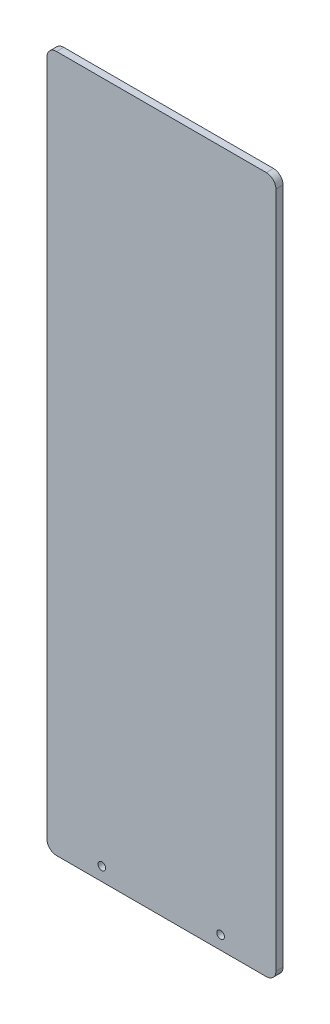
ISO-10303-21;
HEADER;
FILE_DESCRIPTION(('STEP AP214'),'2;1');
FILE_NAME('part.step','',(''),(''),'','','');
FILE_SCHEMA(('AUTOMOTIVE_DESIGN { 1 0 10303 214 1 1 1 1 }'));
ENDSEC;
DATA;
#1=APPLICATION_CONTEXT('core data for automotive mechanical design processes');
#2=APPLICATION_PROTOCOL_DEFINITION('international standard','automotive_design',2000,#1);
#3=PRODUCT_CONTEXT('',#1,'mechanical');
#4=PRODUCT('Part','Part','',(#3));
#5=PRODUCT_RELATED_PRODUCT_CATEGORY('part','',(#4));
#6=PRODUCT_DEFINITION_FORMATION('','',#4);
#7=PRODUCT_DEFINITION_CONTEXT('part definition',#1,'design');
#8=PRODUCT_DEFINITION('design','',#6,#7);
#9=PRODUCT_DEFINITION_SHAPE('','',#8);
#10=(LENGTH_UNIT() NAMED_UNIT(*) SI_UNIT(.MILLI.,.METRE.));
#11=(NAMED_UNIT(*) PLANE_ANGLE_UNIT() SI_UNIT($,.RADIAN.));
#12=(NAMED_UNIT(*) SI_UNIT($,.STERADIAN.) SOLID_ANGLE_UNIT());
#13=UNCERTAINTY_MEASURE_WITH_UNIT(LENGTH_MEASURE(1.E-05),#10,'distance_accuracy_value','');
#14=(GEOMETRIC_REPRESENTATION_CONTEXT(3) GLOBAL_UNCERTAINTY_ASSIGNED_CONTEXT((#13)) GLOBAL_UNIT_ASSIGNED_CONTEXT((#10,
#11,#12)) REPRESENTATION_CONTEXT('',''));
#15=CARTESIAN_POINT('',(0.,0.,0.));
#16=DIRECTION('',(0.,0.,1.));
#17=DIRECTION('',(1.,0.,0.));
#18=AXIS2_PLACEMENT_3D('',#15,#16,#17);
#19=CARTESIAN_POINT('',(0.,463.55,4.7625));
#20=DIRECTION('',(1.,0.,0.));
#21=DIRECTION('',(0.,1.,0.));
#22=AXIS2_PLACEMENT_3D('',#19,#20,#21);
#23=PLANE('',#22);
#24=DIRECTION('',(0.,-1.,0.));
#25=VECTOR('',#24,1.);
#26=CARTESIAN_POINT('',(0.,463.55,0.));
#27=LINE('',#26,#25);
#28=CARTESIAN_POINT('',(0.,457.2,0.));
#29=VERTEX_POINT('',#28);
#30=CARTESIAN_POINT('',(0.,6.35000000000002,0.));
#31=VERTEX_POINT('',#30);
#32=EDGE_CURVE('E132',#29,#31,#27,.T.);
#33=ORIENTED_EDGE('',*,*,#32,.T.);
#34=DIRECTION('',(0.,0.,-1.));
#35=VECTOR('',#34,1.);
#36=CARTESIAN_POINT('',(0.,6.35000000000002,4.7625));
#37=LINE('',#36,#35);
#38=CARTESIAN_POINT('',(0.,6.35000000000002,4.7625));
#39=VERTEX_POINT('',#38);
#40=EDGE_CURVE('E154',#31,#39,#37,.F.);
#41=ORIENTED_EDGE('',*,*,#40,.T.);
#42=DIRECTION('',(0.,-1.,0.));
#43=VECTOR('',#42,1.);
#44=CARTESIAN_POINT('',(0.,463.55,4.7625));
#45=LINE('',#44,#43);
#46=CARTESIAN_POINT('',(0.,457.2,4.7625));
#47=VERTEX_POINT('',#46);
#48=EDGE_CURVE('E130',#47,#39,#45,.T.);
#49=ORIENTED_EDGE('',*,*,#48,.F.);
#50=DIRECTION('',(0.,0.,-1.));
#51=VECTOR('',#50,1.);
#52=CARTESIAN_POINT('',(0.,457.2,4.7625));
#53=LINE('',#52,#51);
#54=EDGE_CURVE('E151',#47,#29,#53,.T.);
#55=ORIENTED_EDGE('',*,*,#54,.T.);
#56=EDGE_LOOP('',(#33,#41,#49,#55));
#57=FACE_BOUND('',#56,.T.);
#58=ADVANCED_FACE('F33',(#57),#23,.F.);
#59=CARTESIAN_POINT('',(0.,0.,4.7625));
#60=DIRECTION('',(0.,1.,0.));
#61=DIRECTION('',(0.,0.,1.));
#62=AXIS2_PLACEMENT_3D('',#59,#60,#61);
#63=PLANE('',#62);
#64=DIRECTION('',(1.,0.,0.));
#65=VECTOR('',#64,1.);
#66=CARTESIAN_POINT('',(0.,0.,0.));
#67=LINE('',#66,#65);
#68=CARTESIAN_POINT('',(6.35,0.,0.));
#69=VERTEX_POINT('',#68);
#70=CARTESIAN_POINT('',(146.05,0.,0.));
#71=VERTEX_POINT('',#70);
#72=EDGE_CURVE('E128',#69,#71,#67,.T.);
#73=ORIENTED_EDGE('',*,*,#72,.T.);
#74=DIRECTION('',(0.,0.,-1.));
#75=VECTOR('',#74,1.);
#76=CARTESIAN_POINT('',(146.05,0.,4.7625));
#77=LINE('',#76,#75);
#78=CARTESIAN_POINT('',(146.05,0.,4.7625));
#79=VERTEX_POINT('',#78);
#80=EDGE_CURVE('E106',#71,#79,#77,.F.);
#81=ORIENTED_EDGE('',*,*,#80,.T.);
#82=DIRECTION('',(1.,0.,0.));
#83=VECTOR('',#82,1.);
#84=CARTESIAN_POINT('',(0.,0.,4.7625));
#85=LINE('',#84,#83);
#86=CARTESIAN_POINT('',(6.35,0.,4.7625));
#87=VERTEX_POINT('',#86);
#88=EDGE_CURVE('E172',#87,#79,#85,.T.);
#89=ORIENTED_EDGE('',*,*,#88,.F.);
#90=DIRECTION('',(0.,0.,-1.));
#91=VECTOR('',#90,1.);
#92=CARTESIAN_POINT('',(6.35,0.,4.7625));
#93=LINE('',#92,#91);
#94=EDGE_CURVE('E111',#87,#69,#93,.T.);
#95=ORIENTED_EDGE('',*,*,#94,.T.);
#96=EDGE_LOOP('',(#73,#81,#89,#95));
#97=FACE_BOUND('',#96,.T.);
#98=ADVANCED_FACE('F191',(#97),#63,.F.);
#99=CARTESIAN_POINT('',(152.4,463.55,4.7625));
#100=DIRECTION('',(-1.,0.,0.));
#101=DIRECTION('',(0.,-1.,0.));
#102=AXIS2_PLACEMENT_3D('',#99,#100,#101);
#103=PLANE('',#102);
#104=DIRECTION('',(0.,1.,0.));
#105=VECTOR('',#104,1.);
#106=CARTESIAN_POINT('',(152.4,463.55,4.7625));
#107=LINE('',#106,#105);
#108=CARTESIAN_POINT('',(152.4,6.35000000000002,4.7625));
#109=VERTEX_POINT('',#108);
#110=CARTESIAN_POINT('',(152.4,457.2,4.7625));
#111=VERTEX_POINT('',#110);
#112=EDGE_CURVE('E120',#109,#111,#107,.T.);
#113=ORIENTED_EDGE('',*,*,#112,.F.);
#114=DIRECTION('',(0.,0.,-1.));
#115=VECTOR('',#114,1.);
#116=CARTESIAN_POINT('',(152.4,6.35000000000002,4.7625));
#117=LINE('',#116,#115);
#118=CARTESIAN_POINT('',(152.4,6.35000000000002,0.));
#119=VERTEX_POINT('',#118);
#120=EDGE_CURVE('E105',#109,#119,#117,.T.);
#121=ORIENTED_EDGE('',*,*,#120,.T.);
#122=DIRECTION('',(0.,1.,0.));
#123=VECTOR('',#122,1.);
#124=CARTESIAN_POINT('',(152.4,463.55,0.));
#125=LINE('',#124,#123);
#126=CARTESIAN_POINT('',(152.4,457.2,0.));
#127=VERTEX_POINT('',#126);
#128=EDGE_CURVE('E118',#119,#127,#125,.T.);
#129=ORIENTED_EDGE('',*,*,#128,.T.);
#130=DIRECTION('',(0.,0.,-1.));
#131=VECTOR('',#130,1.);
#132=CARTESIAN_POINT('',(152.4,457.2,4.7625));
#133=LINE('',#132,#131);
#134=EDGE_CURVE('E122',#127,#111,#133,.F.);
#135=ORIENTED_EDGE('',*,*,#134,.T.);
#136=EDGE_LOOP('',(#113,#121,#129,#135));
#137=FACE_BOUND('',#136,.T.);
#138=ADVANCED_FACE('F117',(#137),#103,.F.);
#139=CARTESIAN_POINT('',(0.,463.55,4.7625));
#140=DIRECTION('',(0.,-1.,0.));
#141=DIRECTION('',(0.,0.,-1.));
#142=AXIS2_PLACEMENT_3D('',#139,#140,#141);
#143=PLANE('',#142);
#144=DIRECTION('',(-1.,0.,0.));
#145=VECTOR('',#144,1.);
#146=CARTESIAN_POINT('',(0.,463.55,4.7625));
#147=LINE('',#146,#145);
#148=CARTESIAN_POINT('',(146.05,463.55,4.7625));
#149=VERTEX_POINT('',#148);
#150=CARTESIAN_POINT('',(6.34999999999999,463.55,4.7625));
#151=VERTEX_POINT('',#150);
#152=EDGE_CURVE('E136',#149,#151,#147,.T.);
#153=ORIENTED_EDGE('',*,*,#152,.F.);
#154=DIRECTION('',(0.,0.,-1.));
#155=VECTOR('',#154,1.);
#156=CARTESIAN_POINT('',(146.05,463.55,4.7625));
#157=LINE('',#156,#155);
#158=CARTESIAN_POINT('',(146.05,463.55,0.));
#159=VERTEX_POINT('',#158);
#160=EDGE_CURVE('E11',#149,#159,#157,.T.);
#161=ORIENTED_EDGE('',*,*,#160,.T.);
#162=DIRECTION('',(-1.,0.,0.));
#163=VECTOR('',#162,1.);
#164=CARTESIAN_POINT('',(0.,463.55,0.));
#165=LINE('',#164,#163);
#166=CARTESIAN_POINT('',(6.34999999999999,463.55,0.));
#167=VERTEX_POINT('',#166);
#168=EDGE_CURVE('E127',#159,#167,#165,.T.);
#169=ORIENTED_EDGE('',*,*,#168,.T.);
#170=DIRECTION('',(0.,0.,-1.));
#171=VECTOR('',#170,1.);
#172=CARTESIAN_POINT('',(6.34999999999999,463.55,4.7625));
#173=LINE('',#172,#171);
#174=EDGE_CURVE('E42',#167,#151,#173,.F.);
#175=ORIENTED_EDGE('',*,*,#174,.T.);
#176=EDGE_LOOP('',(#153,#161,#169,#175));
#177=FACE_BOUND('',#176,.T.);
#178=ADVANCED_FACE('F194',(#177),#143,.F.);
#179=CARTESIAN_POINT('',(0.,0.,4.7625));
#180=DIRECTION('',(0.,0.,1.));
#181=DIRECTION('',(1.,0.,0.));
#182=AXIS2_PLACEMENT_3D('',#179,#180,#181);
#183=PLANE('',#182);
#184=CARTESIAN_POINT('',(36.5329890972248,8.9535,4.7625));
#185=DIRECTION('',(0.,0.,1.));
#186=DIRECTION('',(1.,0.,0.));
#187=AXIS2_PLACEMENT_3D('',#184,#185,#186);
#188=CIRCLE('',#187,2.54);
#189=CARTESIAN_POINT('',(39.0729890972248,8.9535,4.7625));
#190=VERTEX_POINT('',#189);
#191=EDGE_CURVE('E167',#190,#190,#188,.T.);
#192=ORIENTED_EDGE('',*,*,#191,.F.);
#193=EDGE_LOOP('',(#192));
#194=FACE_BOUND('',#193,.T.);
#195=CARTESIAN_POINT('',(115.57,8.9535,4.7625));
#196=DIRECTION('',(0.,0.,1.));
#197=DIRECTION('',(1.,0.,0.));
#198=AXIS2_PLACEMENT_3D('',#195,#196,#197);
#199=CIRCLE('',#198,2.54);
#200=CARTESIAN_POINT('',(118.11,8.9535,4.7625));
#201=VERTEX_POINT('',#200);
#202=EDGE_CURVE('E158',#201,#201,#199,.T.);
#203=ORIENTED_EDGE('',*,*,#202,.F.);
#204=EDGE_LOOP('',(#203));
#205=FACE_BOUND('',#204,.T.);
#206=ORIENTED_EDGE('',*,*,#88,.T.);
#207=CARTESIAN_POINT('',(146.05,6.35000000000002,4.7625));
#208=DIRECTION('',(0.,0.,1.));
#209=DIRECTION('',(1.,0.,0.));
#210=AXIS2_PLACEMENT_3D('',#207,#208,#209);
#211=CIRCLE('',#210,6.35);
#212=EDGE_CURVE('E149',#79,#109,#211,.T.);
#213=ORIENTED_EDGE('',*,*,#212,.T.);
#214=ORIENTED_EDGE('',*,*,#112,.T.);
#215=CARTESIAN_POINT('',(146.05,457.2,4.7625));
#216=DIRECTION('',(0.,0.,1.));
#217=DIRECTION('',(1.,0.,0.));
#218=AXIS2_PLACEMENT_3D('',#215,#216,#217);
#219=CIRCLE('',#218,6.35);
#220=EDGE_CURVE('E56',#111,#149,#219,.T.);
#221=ORIENTED_EDGE('',*,*,#220,.T.);
#222=ORIENTED_EDGE('',*,*,#152,.T.);
#223=CARTESIAN_POINT('',(6.34999999999999,457.2,4.7625));
#224=DIRECTION('',(0.,0.,1.));
#225=DIRECTION('',(1.,0.,0.));
#226=AXIS2_PLACEMENT_3D('',#223,#224,#225);
#227=CIRCLE('',#226,6.35);
#228=EDGE_CURVE('E144',#151,#47,#227,.T.);
#229=ORIENTED_EDGE('',*,*,#228,.T.);
#230=ORIENTED_EDGE('',*,*,#48,.T.);
#231=CARTESIAN_POINT('',(6.35,6.35,4.7625));
#232=DIRECTION('',(0.,0.,1.));
#233=DIRECTION('',(1.,0.,0.));
#234=AXIS2_PLACEMENT_3D('',#231,#232,#233);
#235=CIRCLE('',#234,6.35);
#236=EDGE_CURVE('E147',#39,#87,#235,.T.);
#237=ORIENTED_EDGE('',*,*,#236,.T.);
#238=EDGE_LOOP('',(#206,#213,#214,#221,#222,#229,#230,#237));
#239=FACE_BOUND('',#238,.T.);
#240=ADVANCED_FACE('F177',(#194,#205,#239),#183,.T.);
#241=CARTESIAN_POINT('',(0.,0.,0.));
#242=DIRECTION('',(0.,0.,1.));
#243=DIRECTION('',(1.,0.,0.));
#244=AXIS2_PLACEMENT_3D('',#241,#242,#243);
#245=PLANE('',#244);
#246=CARTESIAN_POINT('',(36.5329890972248,8.9535,0.));
#247=DIRECTION('',(0.,0.,1.));
#248=DIRECTION('',(1.,0.,0.));
#249=AXIS2_PLACEMENT_3D('',#246,#247,#248);
#250=CIRCLE('',#249,2.54);
#251=CARTESIAN_POINT('',(39.0729890972248,8.9535,0.));
#252=VERTEX_POINT('',#251);
#253=EDGE_CURVE('E37',#252,#252,#250,.T.);
#254=ORIENTED_EDGE('',*,*,#253,.T.);
#255=EDGE_LOOP('',(#254));
#256=FACE_BOUND('',#255,.T.);
#257=CARTESIAN_POINT('',(115.57,8.9535,0.));
#258=DIRECTION('',(0.,0.,1.));
#259=DIRECTION('',(1.,0.,0.));
#260=AXIS2_PLACEMENT_3D('',#257,#258,#259);
#261=CIRCLE('',#260,2.54);
#262=CARTESIAN_POINT('',(118.11,8.9535,0.));
#263=VERTEX_POINT('',#262);
#264=EDGE_CURVE('E156',#263,#263,#261,.T.);
#265=ORIENTED_EDGE('',*,*,#264,.T.);
#266=EDGE_LOOP('',(#265));
#267=FACE_BOUND('',#266,.T.);
#268=ORIENTED_EDGE('',*,*,#128,.F.);
#269=CARTESIAN_POINT('',(146.05,6.35000000000002,0.));
#270=DIRECTION('',(0.,0.,1.));
#271=DIRECTION('',(1.,0.,0.));
#272=AXIS2_PLACEMENT_3D('',#269,#270,#271);
#273=CIRCLE('',#272,6.35);
#274=EDGE_CURVE('E101',#119,#71,#273,.F.);
#275=ORIENTED_EDGE('',*,*,#274,.T.);
#276=ORIENTED_EDGE('',*,*,#72,.F.);
#277=CARTESIAN_POINT('',(6.35,6.35,0.));
#278=DIRECTION('',(0.,0.,1.));
#279=DIRECTION('',(1.,0.,0.));
#280=AXIS2_PLACEMENT_3D('',#277,#278,#279);
#281=CIRCLE('',#280,6.35);
#282=EDGE_CURVE('E112',#69,#31,#281,.F.);
#283=ORIENTED_EDGE('',*,*,#282,.T.);
#284=ORIENTED_EDGE('',*,*,#32,.F.);
#285=CARTESIAN_POINT('',(6.34999999999999,457.2,0.));
#286=DIRECTION('',(0.,0.,1.));
#287=DIRECTION('',(1.,0.,0.));
#288=AXIS2_PLACEMENT_3D('',#285,#286,#287);
#289=CIRCLE('',#288,6.35);
#290=EDGE_CURVE('E121',#29,#167,#289,.F.);
#291=ORIENTED_EDGE('',*,*,#290,.T.);
#292=ORIENTED_EDGE('',*,*,#168,.F.);
#293=CARTESIAN_POINT('',(146.05,457.2,0.));
#294=DIRECTION('',(0.,0.,1.));
#295=DIRECTION('',(1.,0.,0.));
#296=AXIS2_PLACEMENT_3D('',#293,#294,#295);
#297=CIRCLE('',#296,6.35);
#298=EDGE_CURVE('E126',#159,#127,#297,.F.);
#299=ORIENTED_EDGE('',*,*,#298,.T.);
#300=EDGE_LOOP('',(#268,#275,#276,#283,#284,#291,#292,#299));
#301=FACE_BOUND('',#300,.T.);
#302=ADVANCED_FACE('F124',(#256,#267,#301),#245,.F.);
#303=CARTESIAN_POINT('',(146.05,6.35000000000002,4.7625));
#304=DIRECTION('',(0.,0.,-1.));
#305=DIRECTION('',(-1.,0.,0.));
#306=AXIS2_PLACEMENT_3D('',#303,#304,#305);
#307=CYLINDRICAL_SURFACE('',#306,6.35);
#308=ORIENTED_EDGE('',*,*,#212,.F.);
#309=ORIENTED_EDGE('',*,*,#80,.F.);
#310=ORIENTED_EDGE('',*,*,#274,.F.);
#311=ORIENTED_EDGE('',*,*,#120,.F.);
#312=EDGE_LOOP('',(#308,#309,#310,#311));
#313=FACE_BOUND('',#312,.T.);
#314=ADVANCED_FACE('F104',(#313),#307,.T.);
#315=CARTESIAN_POINT('',(6.35,6.35,4.7625));
#316=DIRECTION('',(0.,0.,-1.));
#317=DIRECTION('',(-1.,0.,0.));
#318=AXIS2_PLACEMENT_3D('',#315,#316,#317);
#319=CYLINDRICAL_SURFACE('',#318,6.35);
#320=ORIENTED_EDGE('',*,*,#236,.F.);
#321=ORIENTED_EDGE('',*,*,#40,.F.);
#322=ORIENTED_EDGE('',*,*,#282,.F.);
#323=ORIENTED_EDGE('',*,*,#94,.F.);
#324=EDGE_LOOP('',(#320,#321,#322,#323));
#325=FACE_BOUND('',#324,.T.);
#326=ADVANCED_FACE('F188',(#325),#319,.T.);
#327=CARTESIAN_POINT('',(146.05,457.2,4.7625));
#328=DIRECTION('',(0.,0.,-1.));
#329=DIRECTION('',(-1.,0.,0.));
#330=AXIS2_PLACEMENT_3D('',#327,#328,#329);
#331=CYLINDRICAL_SURFACE('',#330,6.35);
#332=ORIENTED_EDGE('',*,*,#220,.F.);
#333=ORIENTED_EDGE('',*,*,#134,.F.);
#334=ORIENTED_EDGE('',*,*,#298,.F.);
#335=ORIENTED_EDGE('',*,*,#160,.F.);
#336=EDGE_LOOP('',(#332,#333,#334,#335));
#337=FACE_BOUND('',#336,.T.);
#338=ADVANCED_FACE('F193',(#337),#331,.T.);
#339=CARTESIAN_POINT('',(6.34999999999999,457.2,4.7625));
#340=DIRECTION('',(0.,0.,-1.));
#341=DIRECTION('',(-1.,0.,0.));
#342=AXIS2_PLACEMENT_3D('',#339,#340,#341);
#343=CYLINDRICAL_SURFACE('',#342,6.35);
#344=ORIENTED_EDGE('',*,*,#228,.F.);
#345=ORIENTED_EDGE('',*,*,#174,.F.);
#346=ORIENTED_EDGE('',*,*,#290,.F.);
#347=ORIENTED_EDGE('',*,*,#54,.F.);
#348=EDGE_LOOP('',(#344,#345,#346,#347));
#349=FACE_BOUND('',#348,.T.);
#350=ADVANCED_FACE('F35',(#349),#343,.T.);
#351=CARTESIAN_POINT('',(115.57,8.9535,-2.8575));
#352=DIRECTION('',(0.,0.,1.));
#353=DIRECTION('',(1.,0.,0.));
#354=AXIS2_PLACEMENT_3D('',#351,#352,#353);
#355=CYLINDRICAL_SURFACE('',#354,2.54);
#356=ORIENTED_EDGE('',*,*,#202,.T.);
#357=EDGE_LOOP('',(#356));
#358=FACE_BOUND('',#357,.T.);
#359=ORIENTED_EDGE('',*,*,#264,.F.);
#360=EDGE_LOOP('',(#359));
#361=FACE_BOUND('',#360,.T.);
#362=ADVANCED_FACE('F220',(#358,#361),#355,.F.);
#363=CARTESIAN_POINT('',(36.5329890972248,8.9535,-2.8575));
#364=DIRECTION('',(0.,0.,1.));
#365=DIRECTION('',(1.,0.,0.));
#366=AXIS2_PLACEMENT_3D('',#363,#364,#365);
#367=CYLINDRICAL_SURFACE('',#366,2.54);
#368=ORIENTED_EDGE('',*,*,#191,.T.);
#369=EDGE_LOOP('',(#368));
#370=FACE_BOUND('',#369,.T.);
#371=ORIENTED_EDGE('',*,*,#253,.F.);
#372=EDGE_LOOP('',(#371));
#373=FACE_BOUND('',#372,.T.);
#374=ADVANCED_FACE('F224',(#370,#373),#367,.F.);
#375=CLOSED_SHELL('',(#58,#98,#138,#178,#240,#302,#314,#326,#338,#350,#362,#374));
#376=MANIFOLD_SOLID_BREP('B2',#375);
#377=ADVANCED_BREP_SHAPE_REPRESENTATION('',(#18,#376),#14);
#378=SHAPE_DEFINITION_REPRESENTATION(#9,#377);
ENDSEC;
END-ISO-10303-21;
